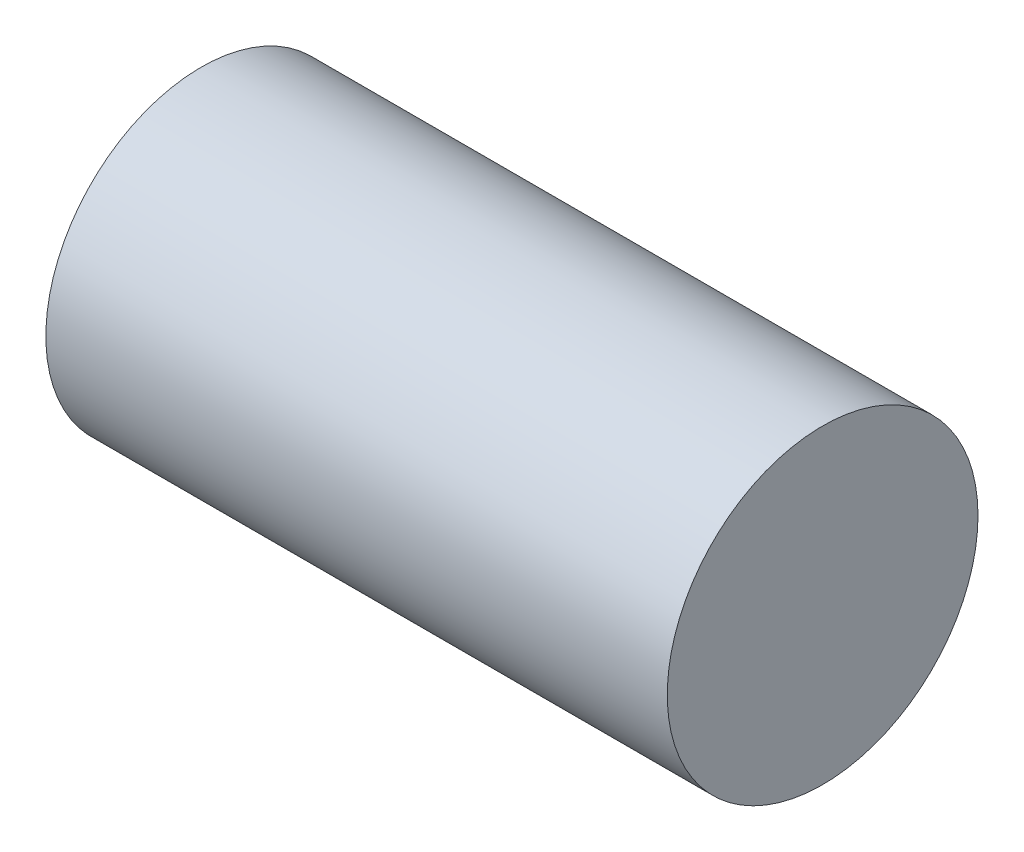
ISO-10303-21;
HEADER;
FILE_DESCRIPTION(('STEP AP214'),'2;1');
FILE_NAME('part.step','',(''),(''),'','','');
FILE_SCHEMA(('AUTOMOTIVE_DESIGN { 1 0 10303 214 1 1 1 1 }'));
ENDSEC;
DATA;
#1=APPLICATION_CONTEXT('core data for automotive mechanical design processes');
#2=APPLICATION_PROTOCOL_DEFINITION('international standard','automotive_design',2000,#1);
#3=PRODUCT_CONTEXT('',#1,'mechanical');
#4=PRODUCT('Part','Part','',(#3));
#5=PRODUCT_RELATED_PRODUCT_CATEGORY('part','',(#4));
#6=PRODUCT_DEFINITION_FORMATION('','',#4);
#7=PRODUCT_DEFINITION_CONTEXT('part definition',#1,'design');
#8=PRODUCT_DEFINITION('design','',#6,#7);
#9=PRODUCT_DEFINITION_SHAPE('','',#8);
#10=(LENGTH_UNIT() NAMED_UNIT(*) SI_UNIT(.MILLI.,.METRE.));
#11=(NAMED_UNIT(*) PLANE_ANGLE_UNIT() SI_UNIT($,.RADIAN.));
#12=(NAMED_UNIT(*) SI_UNIT($,.STERADIAN.) SOLID_ANGLE_UNIT());
#13=UNCERTAINTY_MEASURE_WITH_UNIT(LENGTH_MEASURE(1.E-05),#10,'distance_accuracy_value','');
#14=(GEOMETRIC_REPRESENTATION_CONTEXT(3) GLOBAL_UNCERTAINTY_ASSIGNED_CONTEXT((#13)) GLOBAL_UNIT_ASSIGNED_CONTEXT((#10,
#11,#12)) REPRESENTATION_CONTEXT('',''));
#15=CARTESIAN_POINT('',(0.,0.,0.));
#16=DIRECTION('',(0.,0.,1.));
#17=DIRECTION('',(1.,0.,0.));
#18=AXIS2_PLACEMENT_3D('',#15,#16,#17);
#19=CARTESIAN_POINT('',(60.,0.,0.));
#20=DIRECTION('',(-1.,0.,0.));
#21=DIRECTION('',(0.,0.,1.));
#22=AXIS2_PLACEMENT_3D('',#19,#20,#21);
#23=CYLINDRICAL_SURFACE('',#22,15.);
#24=CARTESIAN_POINT('',(60.,0.,0.));
#25=DIRECTION('',(1.,0.,0.));
#26=DIRECTION('',(0.,0.,-1.));
#27=AXIS2_PLACEMENT_3D('',#24,#25,#26);
#28=CIRCLE('',#27,15.);
#29=CARTESIAN_POINT('',(60.,0.,-15.));
#30=VERTEX_POINT('',#29);
#31=EDGE_CURVE('E10',#30,#30,#28,.T.);
#32=ORIENTED_EDGE('',*,*,#31,.F.);
#33=EDGE_LOOP('',(#32));
#34=FACE_BOUND('',#33,.T.);
#35=CARTESIAN_POINT('',(0.,0.,0.));
#36=DIRECTION('',(1.,0.,0.));
#37=DIRECTION('',(0.,0.,-1.));
#38=AXIS2_PLACEMENT_3D('',#35,#36,#37);
#39=CIRCLE('',#38,15.);
#40=CARTESIAN_POINT('',(0.,0.,-15.));
#41=VERTEX_POINT('',#40);
#42=EDGE_CURVE('E34',#41,#41,#39,.T.);
#43=ORIENTED_EDGE('',*,*,#42,.T.);
#44=EDGE_LOOP('',(#43));
#45=FACE_BOUND('',#44,.T.);
#46=ADVANCED_FACE('F31',(#34,#45),#23,.T.);
#47=CARTESIAN_POINT('',(60.,0.,0.));
#48=DIRECTION('',(1.,0.,0.));
#49=DIRECTION('',(0.,0.,-1.));
#50=AXIS2_PLACEMENT_3D('',#47,#48,#49);
#51=PLANE('',#50);
#52=ORIENTED_EDGE('',*,*,#31,.T.);
#53=EDGE_LOOP('',(#52));
#54=FACE_BOUND('',#53,.T.);
#55=ADVANCED_FACE('F46',(#54),#51,.T.);
#56=CARTESIAN_POINT('',(0.,0.,0.));
#57=DIRECTION('',(1.,0.,0.));
#58=DIRECTION('',(0.,0.,-1.));
#59=AXIS2_PLACEMENT_3D('',#56,#57,#58);
#60=PLANE('',#59);
#61=ORIENTED_EDGE('',*,*,#42,.F.);
#62=EDGE_LOOP('',(#61));
#63=FACE_BOUND('',#62,.T.);
#64=ADVANCED_FACE('F44',(#63),#60,.F.);
#65=CLOSED_SHELL('',(#46,#55,#64));
#66=MANIFOLD_SOLID_BREP('B2',#65);
#67=ADVANCED_BREP_SHAPE_REPRESENTATION('',(#18,#66),#14);
#68=SHAPE_DEFINITION_REPRESENTATION(#9,#67);
ENDSEC;
END-ISO-10303-21;
